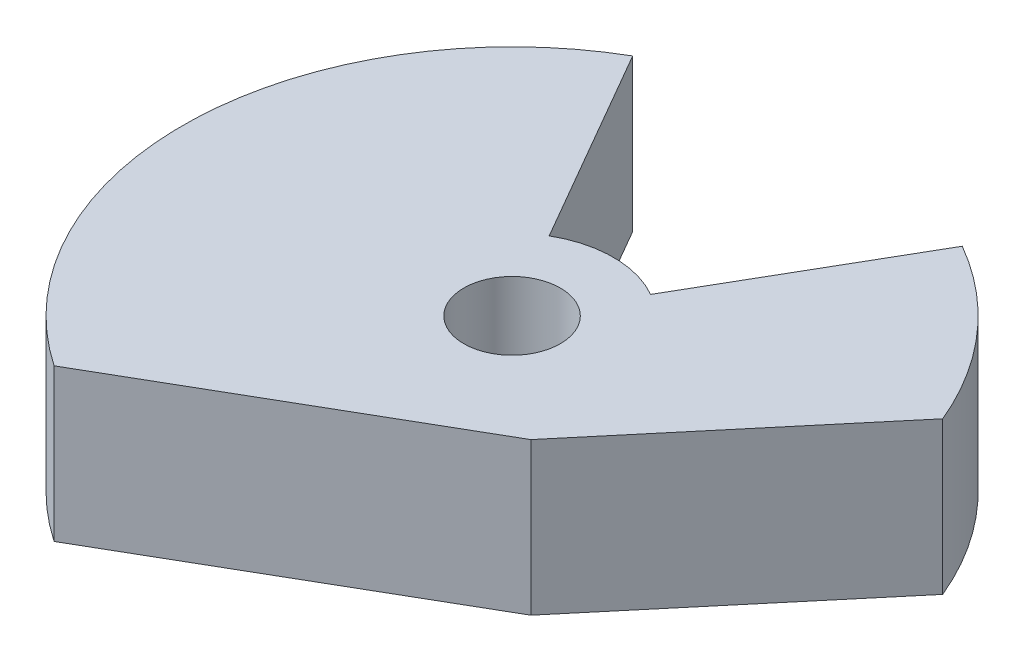
ISO-10303-21;
HEADER;
FILE_DESCRIPTION(('STEP AP214'),'2;1');
FILE_NAME('part.step','',(''),(''),'','','');
FILE_SCHEMA(('AUTOMOTIVE_DESIGN { 1 0 10303 214 1 1 1 1 }'));
ENDSEC;
DATA;
#1=APPLICATION_CONTEXT('core data for automotive mechanical design processes');
#2=APPLICATION_PROTOCOL_DEFINITION('international standard','automotive_design',2000,#1);
#3=PRODUCT_CONTEXT('',#1,'mechanical');
#4=PRODUCT('Part','Part','',(#3));
#5=PRODUCT_RELATED_PRODUCT_CATEGORY('part','',(#4));
#6=PRODUCT_DEFINITION_FORMATION('','',#4);
#7=PRODUCT_DEFINITION_CONTEXT('part definition',#1,'design');
#8=PRODUCT_DEFINITION('design','',#6,#7);
#9=PRODUCT_DEFINITION_SHAPE('','',#8);
#10=(LENGTH_UNIT() NAMED_UNIT(*) SI_UNIT(.MILLI.,.METRE.));
#11=(NAMED_UNIT(*) PLANE_ANGLE_UNIT() SI_UNIT($,.RADIAN.));
#12=(NAMED_UNIT(*) SI_UNIT($,.STERADIAN.) SOLID_ANGLE_UNIT());
#13=UNCERTAINTY_MEASURE_WITH_UNIT(LENGTH_MEASURE(1.E-05),#10,'distance_accuracy_value','');
#14=(GEOMETRIC_REPRESENTATION_CONTEXT(3) GLOBAL_UNCERTAINTY_ASSIGNED_CONTEXT((#13)) GLOBAL_UNIT_ASSIGNED_CONTEXT((#10,
#11,#12)) REPRESENTATION_CONTEXT('',''));
#15=CARTESIAN_POINT('',(0.,0.,0.));
#16=DIRECTION('',(0.,0.,1.));
#17=DIRECTION('',(1.,0.,0.));
#18=AXIS2_PLACEMENT_3D('',#15,#16,#17);
#19=CARTESIAN_POINT('',(0.,15.,0.));
#20=DIRECTION('',(0.,-1.,0.));
#21=DIRECTION('',(0.,0.,-1.));
#22=AXIS2_PLACEMENT_3D('',#19,#20,#21);
#23=CYLINDRICAL_SURFACE('',#22,32.5);
#24=CARTESIAN_POINT('',(0.,0.,0.));
#25=DIRECTION('',(0.,1.,0.));
#26=DIRECTION('',(0.,0.,1.));
#27=AXIS2_PLACEMENT_3D('',#24,#25,#26);
#28=CIRCLE('',#27,32.5);
#29=CARTESIAN_POINT('',(-16.2499999999998,0.,-28.1458256229944));
#30=VERTEX_POINT('',#29);
#31=CARTESIAN_POINT('',(-18.3132497293577,0.,26.8491132879688));
#32=VERTEX_POINT('',#31);
#33=EDGE_CURVE('E164',#30,#32,#28,.T.);
#34=ORIENTED_EDGE('',*,*,#33,.T.);
#35=DIRECTION('',(0.,-1.,0.));
#36=VECTOR('',#35,1.);
#37=CARTESIAN_POINT('',(-18.3132497293577,15.,26.8491132879688));
#38=LINE('',#37,#36);
#39=CARTESIAN_POINT('',(-18.3132497293577,15.,26.8491132879688));
#40=VERTEX_POINT('',#39);
#41=EDGE_CURVE('E11',#32,#40,#38,.F.);
#42=ORIENTED_EDGE('',*,*,#41,.T.);
#43=CARTESIAN_POINT('',(0.,15.,0.));
#44=DIRECTION('',(0.,1.,0.));
#45=DIRECTION('',(0.,0.,1.));
#46=AXIS2_PLACEMENT_3D('',#43,#44,#45);
#47=CIRCLE('',#46,32.5);
#48=CARTESIAN_POINT('',(-16.2499999999998,15.,-28.1458256229944));
#49=VERTEX_POINT('',#48);
#50=EDGE_CURVE('E151',#49,#40,#47,.T.);
#51=ORIENTED_EDGE('',*,*,#50,.F.);
#52=DIRECTION('',(0.,-1.,0.));
#53=VECTOR('',#52,1.);
#54=CARTESIAN_POINT('',(-16.2499999999998,15.,-28.1458256229944));
#55=LINE('',#54,#53);
#56=EDGE_CURVE('E174',#49,#30,#55,.T.);
#57=ORIENTED_EDGE('',*,*,#56,.T.);
#58=EDGE_LOOP('',(#34,#42,#51,#57));
#59=FACE_BOUND('',#58,.T.);
#60=ADVANCED_FACE('F39',(#59),#23,.T.);
#61=CARTESIAN_POINT('',(0.,15.,0.));
#62=DIRECTION('',(0.,1.,0.));
#63=DIRECTION('',(0.,0.,1.));
#64=AXIS2_PLACEMENT_3D('',#61,#62,#63);
#65=PLANE('',#64);
#66=DIRECTION('',(-0.866025403784441,0.,0.499999999999995));
#67=VECTOR('',#66,1.);
#68=CARTESIAN_POINT('',(11.4906666467847,15.,9.64181414529811));
#69=LINE('',#68,#67);
#70=CARTESIAN_POINT('',(11.4906666467847,15.,9.64181414529811));
#71=VERTEX_POINT('',#70);
#72=EDGE_CURVE('E132',#71,#40,#69,.T.);
#73=ORIENTED_EDGE('',*,*,#72,.F.);
#74=DIRECTION('',(-0.64278760968654,0.,0.766044443118977));
#75=VECTOR('',#74,1.);
#76=CARTESIAN_POINT('',(11.4906666467847,15.,9.64181414529811));
#77=LINE('',#76,#75);
#78=CARTESIAN_POINT('',(30.0231375062568,15.,-12.4443245811252));
#79=VERTEX_POINT('',#78);
#80=EDGE_CURVE('E111',#79,#71,#77,.T.);
#81=ORIENTED_EDGE('',*,*,#80,.F.);
#82=CARTESIAN_POINT('',(16.25,15.,-28.1458256229942));
#83=VERTEX_POINT('',#82);
#84=EDGE_CURVE('E150',#79,#83,#47,.T.);
#85=ORIENTED_EDGE('',*,*,#84,.T.);
#86=DIRECTION('',(-0.500000000000001,0.,0.866025403784438));
#87=VECTOR('',#86,1.);
#88=CARTESIAN_POINT('',(5.00000000000001,15.,-8.66025403784438));
#89=LINE('',#88,#87);
#90=CARTESIAN_POINT('',(5.00000000000001,15.,-8.66025403784438));
#91=VERTEX_POINT('',#90);
#92=EDGE_CURVE('E64',#83,#91,#89,.T.);
#93=ORIENTED_EDGE('',*,*,#92,.T.);
#94=CARTESIAN_POINT('',(0.,15.,0.));
#95=DIRECTION('',(0.,1.,0.));
#96=DIRECTION('',(0.,0.,1.));
#97=AXIS2_PLACEMENT_3D('',#94,#95,#96);
#98=CIRCLE('',#97,10.);
#99=CARTESIAN_POINT('',(-4.99999999999995,15.,-8.66025403784441));
#100=VERTEX_POINT('',#99);
#101=EDGE_CURVE('E145',#91,#100,#98,.T.);
#102=ORIENTED_EDGE('',*,*,#101,.T.);
#103=DIRECTION('',(-0.499999999999995,0.,-0.866025403784442));
#104=VECTOR('',#103,1.);
#105=CARTESIAN_POINT('',(-16.2499999999998,15.,-28.1458256229944));
#106=LINE('',#105,#104);
#107=EDGE_CURVE('E93',#100,#49,#106,.T.);
#108=ORIENTED_EDGE('',*,*,#107,.T.);
#109=ORIENTED_EDGE('',*,*,#50,.T.);
#110=EDGE_LOOP('',(#73,#81,#85,#93,#102,#108,#109));
#111=FACE_BOUND('',#110,.T.);
#112=CARTESIAN_POINT('',(0.,15.,0.));
#113=DIRECTION('',(0.,1.,0.));
#114=DIRECTION('',(0.,0.,1.));
#115=AXIS2_PLACEMENT_3D('',#112,#113,#114);
#116=CIRCLE('',#115,4.7625);
#117=CARTESIAN_POINT('',(0.,15.,4.7625));
#118=VERTEX_POINT('',#117);
#119=EDGE_CURVE('E137',#118,#118,#116,.T.);
#120=ORIENTED_EDGE('',*,*,#119,.F.);
#121=EDGE_LOOP('',(#120));
#122=FACE_BOUND('',#121,.T.);
#123=ADVANCED_FACE('F185',(#111,#122),#65,.T.);
#124=CARTESIAN_POINT('',(0.,0.,0.));
#125=DIRECTION('',(0.,1.,0.));
#126=DIRECTION('',(0.,0.,1.));
#127=AXIS2_PLACEMENT_3D('',#124,#125,#126);
#128=PLANE('',#127);
#129=DIRECTION('',(-0.64278760968654,0.,0.766044443118977));
#130=VECTOR('',#129,1.);
#131=CARTESIAN_POINT('',(11.4906666467847,0.,9.64181414529811));
#132=LINE('',#131,#130);
#133=CARTESIAN_POINT('',(30.0231375062568,0.,-12.4443245811252));
#134=VERTEX_POINT('',#133);
#135=CARTESIAN_POINT('',(11.4906666467847,0.,9.64181414529811));
#136=VERTEX_POINT('',#135);
#137=EDGE_CURVE('E55',#134,#136,#132,.T.);
#138=ORIENTED_EDGE('',*,*,#137,.T.);
#139=DIRECTION('',(-0.866025403784441,0.,0.499999999999995));
#140=VECTOR('',#139,1.);
#141=CARTESIAN_POINT('',(11.4906666467847,0.,9.64181414529811));
#142=LINE('',#141,#140);
#143=EDGE_CURVE('E118',#136,#32,#142,.T.);
#144=ORIENTED_EDGE('',*,*,#143,.T.);
#145=ORIENTED_EDGE('',*,*,#33,.F.);
#146=DIRECTION('',(-0.499999999999995,0.,-0.866025403784442));
#147=VECTOR('',#146,1.);
#148=CARTESIAN_POINT('',(-16.2499999999998,0.,-28.1458256229944));
#149=LINE('',#148,#147);
#150=CARTESIAN_POINT('',(-4.99999999999995,0.,-8.66025403784441));
#151=VERTEX_POINT('',#150);
#152=EDGE_CURVE('E161',#151,#30,#149,.T.);
#153=ORIENTED_EDGE('',*,*,#152,.F.);
#154=CARTESIAN_POINT('',(0.,0.,0.));
#155=DIRECTION('',(0.,1.,0.));
#156=DIRECTION('',(0.,0.,1.));
#157=AXIS2_PLACEMENT_3D('',#154,#155,#156);
#158=CIRCLE('',#157,10.);
#159=CARTESIAN_POINT('',(5.00000000000001,0.,-8.66025403784438));
#160=VERTEX_POINT('',#159);
#161=EDGE_CURVE('E141',#160,#151,#158,.T.);
#162=ORIENTED_EDGE('',*,*,#161,.F.);
#163=DIRECTION('',(-0.500000000000001,0.,0.866025403784438));
#164=VECTOR('',#163,1.);
#165=CARTESIAN_POINT('',(5.00000000000001,0.,-8.66025403784438));
#166=LINE('',#165,#164);
#167=CARTESIAN_POINT('',(16.25,0.,-28.1458256229942));
#168=VERTEX_POINT('',#167);
#169=EDGE_CURVE('E85',#168,#160,#166,.T.);
#170=ORIENTED_EDGE('',*,*,#169,.F.);
#171=EDGE_CURVE('E128',#134,#168,#28,.T.);
#172=ORIENTED_EDGE('',*,*,#171,.F.);
#173=EDGE_LOOP('',(#138,#144,#145,#153,#162,#170,#172));
#174=FACE_BOUND('',#173,.T.);
#175=CARTESIAN_POINT('',(0.,0.,0.));
#176=DIRECTION('',(0.,1.,0.));
#177=DIRECTION('',(0.,0.,1.));
#178=AXIS2_PLACEMENT_3D('',#175,#176,#177);
#179=CIRCLE('',#178,4.7625);
#180=CARTESIAN_POINT('',(0.,0.,4.7625));
#181=VERTEX_POINT('',#180);
#182=EDGE_CURVE('E115',#181,#181,#179,.T.);
#183=ORIENTED_EDGE('',*,*,#182,.T.);
#184=EDGE_LOOP('',(#183));
#185=FACE_BOUND('',#184,.T.);
#186=ADVANCED_FACE('F126',(#174,#185),#128,.F.);
#187=CARTESIAN_POINT('',(0.,15.,0.));
#188=DIRECTION('',(0.,-1.,0.));
#189=DIRECTION('',(0.,0.,-1.));
#190=AXIS2_PLACEMENT_3D('',#187,#188,#189);
#191=CYLINDRICAL_SURFACE('',#190,10.);
#192=ORIENTED_EDGE('',*,*,#161,.T.);
#193=DIRECTION('',(0.,-1.,0.));
#194=VECTOR('',#193,1.);
#195=CARTESIAN_POINT('',(-4.99999999999995,15.,-8.66025403784441));
#196=LINE('',#195,#194);
#197=EDGE_CURVE('E178',#100,#151,#196,.T.);
#198=ORIENTED_EDGE('',*,*,#197,.F.);
#199=ORIENTED_EDGE('',*,*,#101,.F.);
#200=DIRECTION('',(0.,-1.,0.));
#201=VECTOR('',#200,1.);
#202=CARTESIAN_POINT('',(5.00000000000001,15.,-8.66025403784438));
#203=LINE('',#202,#201);
#204=EDGE_CURVE('E157',#91,#160,#203,.T.);
#205=ORIENTED_EDGE('',*,*,#204,.T.);
#206=EDGE_LOOP('',(#192,#198,#199,#205));
#207=FACE_BOUND('',#206,.T.);
#208=ADVANCED_FACE('F41',(#207),#191,.T.);
#209=CARTESIAN_POINT('',(-16.2499999999998,15.,-28.1458256229944));
#210=DIRECTION('',(-0.866025403784442,0.,0.499999999999995));
#211=DIRECTION('',(0.499999999999995,0.,0.866025403784442));
#212=AXIS2_PLACEMENT_3D('',#209,#210,#211);
#213=PLANE('',#212);
#214=ORIENTED_EDGE('',*,*,#152,.T.);
#215=ORIENTED_EDGE('',*,*,#56,.F.);
#216=ORIENTED_EDGE('',*,*,#107,.F.);
#217=ORIENTED_EDGE('',*,*,#197,.T.);
#218=EDGE_LOOP('',(#214,#215,#216,#217));
#219=FACE_BOUND('',#218,.T.);
#220=ADVANCED_FACE('F191',(#219),#213,.F.);
#221=ORIENTED_EDGE('',*,*,#84,.F.);
#222=DIRECTION('',(0.,-1.,0.));
#223=VECTOR('',#222,1.);
#224=CARTESIAN_POINT('',(30.0231375062568,15.,-12.4443245811252));
#225=LINE('',#224,#223);
#226=EDGE_CURVE('E48',#79,#134,#225,.T.);
#227=ORIENTED_EDGE('',*,*,#226,.T.);
#228=ORIENTED_EDGE('',*,*,#171,.T.);
#229=DIRECTION('',(0.,-1.,0.));
#230=VECTOR('',#229,1.);
#231=CARTESIAN_POINT('',(16.25,15.,-28.1458256229942));
#232=LINE('',#231,#230);
#233=EDGE_CURVE('E171',#83,#168,#232,.T.);
#234=ORIENTED_EDGE('',*,*,#233,.F.);
#235=EDGE_LOOP('',(#221,#227,#228,#234));
#236=FACE_BOUND('',#235,.T.);
#237=ADVANCED_FACE('F183',(#236),#23,.T.);
#238=CARTESIAN_POINT('',(5.00000000000001,15.,-8.66025403784438));
#239=DIRECTION('',(0.866025403784438,0.,0.500000000000001));
#240=DIRECTION('',(0.500000000000001,0.,-0.866025403784438));
#241=AXIS2_PLACEMENT_3D('',#238,#239,#240);
#242=PLANE('',#241);
#243=ORIENTED_EDGE('',*,*,#169,.T.);
#244=ORIENTED_EDGE('',*,*,#204,.F.);
#245=ORIENTED_EDGE('',*,*,#92,.F.);
#246=ORIENTED_EDGE('',*,*,#233,.T.);
#247=EDGE_LOOP('',(#243,#244,#245,#246));
#248=FACE_BOUND('',#247,.T.);
#249=ADVANCED_FACE('F194',(#248),#242,.F.);
#250=CARTESIAN_POINT('',(0.,15.,0.));
#251=DIRECTION('',(0.,-1.,0.));
#252=DIRECTION('',(0.,0.,-1.));
#253=AXIS2_PLACEMENT_3D('',#250,#251,#252);
#254=CYLINDRICAL_SURFACE('',#253,4.7625);
#255=ORIENTED_EDGE('',*,*,#119,.T.);
#256=EDGE_LOOP('',(#255));
#257=FACE_BOUND('',#256,.T.);
#258=ORIENTED_EDGE('',*,*,#182,.F.);
#259=EDGE_LOOP('',(#258));
#260=FACE_BOUND('',#259,.T.);
#261=ADVANCED_FACE('F196',(#257,#260),#254,.F.);
#262=CARTESIAN_POINT('',(11.4906666467847,0.,9.64181414529811));
#263=DIRECTION('',(-0.499999999999995,0.,-0.866025403784441));
#264=DIRECTION('',(-0.866025403784442,0.,0.499999999999995));
#265=AXIS2_PLACEMENT_3D('',#262,#263,#264);
#266=PLANE('',#265);
#267=ORIENTED_EDGE('',*,*,#143,.F.);
#268=DIRECTION('',(0.,1.,0.));
#269=VECTOR('',#268,1.);
#270=CARTESIAN_POINT('',(11.4906666467847,0.,9.64181414529811));
#271=LINE('',#270,#269);
#272=EDGE_CURVE('E107',#136,#71,#271,.T.);
#273=ORIENTED_EDGE('',*,*,#272,.T.);
#274=ORIENTED_EDGE('',*,*,#72,.T.);
#275=ORIENTED_EDGE('',*,*,#41,.F.);
#276=EDGE_LOOP('',(#267,#273,#274,#275));
#277=FACE_BOUND('',#276,.T.);
#278=ADVANCED_FACE('F119',(#277),#266,.F.);
#279=CARTESIAN_POINT('',(11.4906666467847,0.,9.64181414529811));
#280=DIRECTION('',(-0.766044443118977,0.,-0.64278760968654));
#281=DIRECTION('',(-0.64278760968654,0.,0.766044443118977));
#282=AXIS2_PLACEMENT_3D('',#279,#280,#281);
#283=PLANE('',#282);
#284=ORIENTED_EDGE('',*,*,#80,.T.);
#285=ORIENTED_EDGE('',*,*,#272,.F.);
#286=ORIENTED_EDGE('',*,*,#137,.F.);
#287=ORIENTED_EDGE('',*,*,#226,.F.);
#288=EDGE_LOOP('',(#284,#285,#286,#287));
#289=FACE_BOUND('',#288,.T.);
#290=ADVANCED_FACE('F109',(#289),#283,.F.);
#291=CLOSED_SHELL('',(#60,#123,#186,#208,#220,#237,#249,#261,#278,#290));
#292=MANIFOLD_SOLID_BREP('B2',#291);
#293=ADVANCED_BREP_SHAPE_REPRESENTATION('',(#18,#292),#14);
#294=SHAPE_DEFINITION_REPRESENTATION(#9,#293);
ENDSEC;
END-ISO-10303-21;
